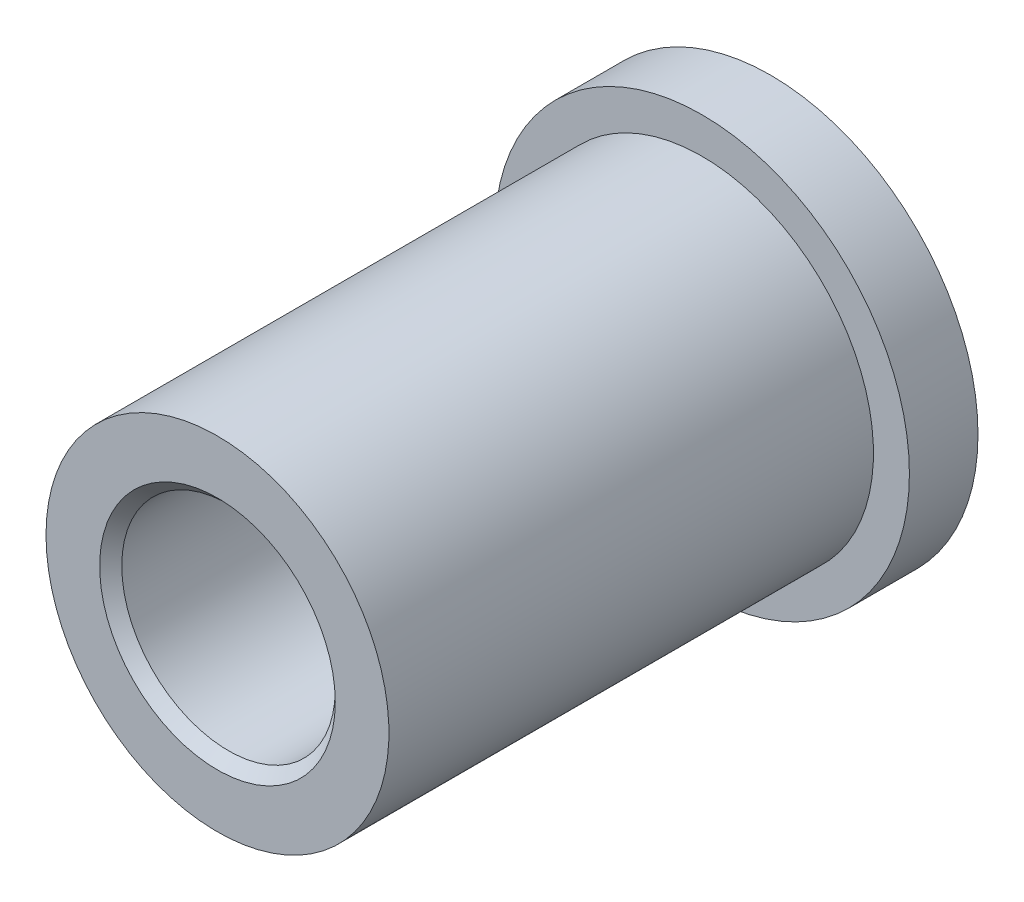
ISO-10303-21;
HEADER;
FILE_DESCRIPTION(('STEP AP214'),'2;1');
FILE_NAME('part.step','',(''),(''),'','','');
FILE_SCHEMA(('AUTOMOTIVE_DESIGN { 1 0 10303 214 1 1 1 1 }'));
ENDSEC;
DATA;
#1=APPLICATION_CONTEXT('core data for automotive mechanical design processes');
#2=APPLICATION_PROTOCOL_DEFINITION('international standard','automotive_design',2000,#1);
#3=PRODUCT_CONTEXT('',#1,'mechanical');
#4=PRODUCT('Part','Part','',(#3));
#5=PRODUCT_RELATED_PRODUCT_CATEGORY('part','',(#4));
#6=PRODUCT_DEFINITION_FORMATION('','',#4);
#7=PRODUCT_DEFINITION_CONTEXT('part definition',#1,'design');
#8=PRODUCT_DEFINITION('design','',#6,#7);
#9=PRODUCT_DEFINITION_SHAPE('','',#8);
#10=(LENGTH_UNIT() NAMED_UNIT(*) SI_UNIT(.MILLI.,.METRE.));
#11=(NAMED_UNIT(*) PLANE_ANGLE_UNIT() SI_UNIT($,.RADIAN.));
#12=(NAMED_UNIT(*) SI_UNIT($,.STERADIAN.) SOLID_ANGLE_UNIT());
#13=UNCERTAINTY_MEASURE_WITH_UNIT(LENGTH_MEASURE(1.E-05),#10,'distance_accuracy_value','');
#14=(GEOMETRIC_REPRESENTATION_CONTEXT(3) GLOBAL_UNCERTAINTY_ASSIGNED_CONTEXT((#13)) GLOBAL_UNIT_ASSIGNED_CONTEXT((#10,
#11,#12)) REPRESENTATION_CONTEXT('',''));
#15=CARTESIAN_POINT('',(0.,0.,0.));
#16=DIRECTION('',(0.,0.,1.));
#17=DIRECTION('',(1.,0.,0.));
#18=AXIS2_PLACEMENT_3D('',#15,#16,#17);
#19=CARTESIAN_POINT('',(2.4511,0.,-12.7));
#20=DIRECTION('',(0.,0.,-1.));
#21=DIRECTION('',(-1.,0.,0.));
#22=AXIS2_PLACEMENT_3D('',#19,#20,#21);
#23=CYLINDRICAL_SURFACE('',#22,3.937);
#24=CARTESIAN_POINT('',(2.4511,0.,0.));
#25=DIRECTION('',(0.,0.,-1.));
#26=DIRECTION('',(-1.,0.,0.));
#27=AXIS2_PLACEMENT_3D('',#24,#25,#26);
#28=CIRCLE('',#27,3.937);
#29=CARTESIAN_POINT('',(-1.4859,0.,0.));
#30=VERTEX_POINT('',#29);
#31=EDGE_CURVE('E57',#30,#30,#28,.T.);
#32=ORIENTED_EDGE('',*,*,#31,.T.);
#33=EDGE_LOOP('',(#32));
#34=FACE_BOUND('',#33,.T.);
#35=CARTESIAN_POINT('',(2.4511,0.,-11.1252));
#36=DIRECTION('',(0.,0.,-1.));
#37=DIRECTION('',(-1.,0.,0.));
#38=AXIS2_PLACEMENT_3D('',#35,#36,#37);
#39=CIRCLE('',#38,3.937);
#40=CARTESIAN_POINT('',(-1.4859,0.,-11.1252));
#41=VERTEX_POINT('',#40);
#42=EDGE_CURVE('E67',#41,#41,#39,.T.);
#43=ORIENTED_EDGE('',*,*,#42,.F.);
#44=EDGE_LOOP('',(#43));
#45=FACE_BOUND('',#44,.T.);
#46=ADVANCED_FACE('F37',(#34,#45),#23,.T.);
#47=CARTESIAN_POINT('',(0.,0.,0.));
#48=DIRECTION('',(0.,0.,1.));
#49=DIRECTION('',(1.,0.,0.));
#50=AXIS2_PLACEMENT_3D('',#47,#48,#49);
#51=PLANE('',#50);
#52=CARTESIAN_POINT('',(2.4511,0.,0.));
#53=DIRECTION('',(0.,0.,1.));
#54=DIRECTION('',(1.,0.,0.));
#55=AXIS2_PLACEMENT_3D('',#52,#53,#54);
#56=CIRCLE('',#55,2.7051);
#57=CARTESIAN_POINT('',(5.1562,0.,0.));
#58=VERTEX_POINT('',#57);
#59=EDGE_CURVE('E52',#58,#58,#56,.F.);
#60=ORIENTED_EDGE('',*,*,#59,.T.);
#61=EDGE_LOOP('',(#60));
#62=FACE_BOUND('',#61,.T.);
#63=ORIENTED_EDGE('',*,*,#31,.F.);
#64=EDGE_LOOP('',(#63));
#65=FACE_BOUND('',#64,.T.);
#66=ADVANCED_FACE('F75',(#62,#65),#51,.T.);
#67=CARTESIAN_POINT('',(2.4511,0.,-12.7));
#68=DIRECTION('',(0.,0.,-1.));
#69=DIRECTION('',(-1.,0.,0.));
#70=AXIS2_PLACEMENT_3D('',#67,#68,#69);
#71=CYLINDRICAL_SURFACE('',#70,2.4511);
#72=CARTESIAN_POINT('',(2.4511,0.,-0.253999999999999));
#73=DIRECTION('',(0.,0.,1.));
#74=DIRECTION('',(1.,0.,0.));
#75=AXIS2_PLACEMENT_3D('',#72,#73,#74);
#76=CIRCLE('',#75,2.4511);
#77=CARTESIAN_POINT('',(4.9022,0.,-0.253999999999999));
#78=VERTEX_POINT('',#77);
#79=EDGE_CURVE('E44',#78,#78,#76,.T.);
#80=ORIENTED_EDGE('',*,*,#79,.T.);
#81=EDGE_LOOP('',(#80));
#82=FACE_BOUND('',#81,.T.);
#83=CARTESIAN_POINT('',(2.4511,0.,-12.446));
#84=DIRECTION('',(0.,0.,-1.));
#85=DIRECTION('',(-1.,0.,0.));
#86=AXIS2_PLACEMENT_3D('',#83,#84,#85);
#87=CIRCLE('',#86,2.4511);
#88=CARTESIAN_POINT('',(0.,0.,-12.446));
#89=VERTEX_POINT('',#88);
#90=EDGE_CURVE('E48',#89,#89,#87,.T.);
#91=ORIENTED_EDGE('',*,*,#90,.T.);
#92=EDGE_LOOP('',(#91));
#93=FACE_BOUND('',#92,.T.);
#94=ADVANCED_FACE('F81',(#82,#93),#71,.F.);
#95=CARTESIAN_POINT('',(0.,0.,-12.7));
#96=DIRECTION('',(0.,0.,-1.));
#97=DIRECTION('',(-1.,0.,0.));
#98=AXIS2_PLACEMENT_3D('',#95,#96,#97);
#99=PLANE('',#98);
#100=CARTESIAN_POINT('',(2.4511,0.,-12.7));
#101=DIRECTION('',(0.,0.,-1.));
#102=DIRECTION('',(-1.,0.,0.));
#103=AXIS2_PLACEMENT_3D('',#100,#101,#102);
#104=CIRCLE('',#103,2.7051);
#105=CARTESIAN_POINT('',(-0.254000000000003,0.,-12.7));
#106=VERTEX_POINT('',#105);
#107=EDGE_CURVE('E10',#106,#106,#104,.F.);
#108=ORIENTED_EDGE('',*,*,#107,.T.);
#109=EDGE_LOOP('',(#108));
#110=FACE_BOUND('',#109,.T.);
#111=CARTESIAN_POINT('',(2.4511,0.,-12.7));
#112=DIRECTION('',(0.,0.,-1.));
#113=DIRECTION('',(-1.,0.,0.));
#114=AXIS2_PLACEMENT_3D('',#111,#112,#113);
#115=CIRCLE('',#114,4.7625);
#116=CARTESIAN_POINT('',(-2.3114,0.,-12.7));
#117=VERTEX_POINT('',#116);
#118=EDGE_CURVE('E61',#117,#117,#115,.T.);
#119=ORIENTED_EDGE('',*,*,#118,.T.);
#120=EDGE_LOOP('',(#119));
#121=FACE_BOUND('',#120,.T.);
#122=ADVANCED_FACE('F102',(#110,#121),#99,.T.);
#123=CARTESIAN_POINT('',(2.4511,0.,-12.7));
#124=DIRECTION('',(0.,0.,-1.));
#125=DIRECTION('',(-1.,0.,0.));
#126=AXIS2_PLACEMENT_3D('',#123,#124,#125);
#127=CYLINDRICAL_SURFACE('',#126,4.7625);
#128=CARTESIAN_POINT('',(2.4511,0.,-11.1252));
#129=DIRECTION('',(0.,0.,-1.));
#130=DIRECTION('',(-1.,0.,0.));
#131=AXIS2_PLACEMENT_3D('',#128,#129,#130);
#132=CIRCLE('',#131,4.7625);
#133=CARTESIAN_POINT('',(-2.3114,0.,-11.1252));
#134=VERTEX_POINT('',#133);
#135=EDGE_CURVE('E64',#134,#134,#132,.T.);
#136=ORIENTED_EDGE('',*,*,#135,.T.);
#137=EDGE_LOOP('',(#136));
#138=FACE_BOUND('',#137,.T.);
#139=ORIENTED_EDGE('',*,*,#118,.F.);
#140=EDGE_LOOP('',(#139));
#141=FACE_BOUND('',#140,.T.);
#142=ADVANCED_FACE('F93',(#138,#141),#127,.T.);
#143=CARTESIAN_POINT('',(0.,0.,-11.1252));
#144=DIRECTION('',(0.,0.,1.));
#145=DIRECTION('',(1.,0.,0.));
#146=AXIS2_PLACEMENT_3D('',#143,#144,#145);
#147=PLANE('',#146);
#148=ORIENTED_EDGE('',*,*,#42,.T.);
#149=EDGE_LOOP('',(#148));
#150=FACE_BOUND('',#149,.T.);
#151=ORIENTED_EDGE('',*,*,#135,.F.);
#152=EDGE_LOOP('',(#151));
#153=FACE_BOUND('',#152,.T.);
#154=ADVANCED_FACE('F71',(#150,#153),#147,.T.);
#155=CARTESIAN_POINT('',(2.4511,0.,0.));
#156=DIRECTION('',(0.,0.,1.));
#157=DIRECTION('',(1.,0.,0.));
#158=AXIS2_PLACEMENT_3D('',#155,#156,#157);
#159=CONICAL_SURFACE('',#158,2.7051,0.785398163397447);
#160=ORIENTED_EDGE('',*,*,#79,.F.);
#161=EDGE_LOOP('',(#160));
#162=FACE_BOUND('',#161,.T.);
#163=ORIENTED_EDGE('',*,*,#59,.F.);
#164=EDGE_LOOP('',(#163));
#165=FACE_BOUND('',#164,.T.);
#166=ADVANCED_FACE('F85',(#162,#165),#159,.F.);
#167=CARTESIAN_POINT('',(2.4511,0.,-12.446));
#168=DIRECTION('',(0.,0.,-1.));
#169=DIRECTION('',(-1.,0.,0.));
#170=AXIS2_PLACEMENT_3D('',#167,#168,#169);
#171=CONICAL_SURFACE('',#170,2.4511,0.785398163397452);
#172=ORIENTED_EDGE('',*,*,#107,.F.);
#173=EDGE_LOOP('',(#172));
#174=FACE_BOUND('',#173,.T.);
#175=ORIENTED_EDGE('',*,*,#90,.F.);
#176=EDGE_LOOP('',(#175));
#177=FACE_BOUND('',#176,.T.);
#178=ADVANCED_FACE('F39',(#174,#177),#171,.F.);
#179=CLOSED_SHELL('',(#46,#66,#94,#122,#142,#154,#166,#178));
#180=MANIFOLD_SOLID_BREP('B2',#179);
#181=ADVANCED_BREP_SHAPE_REPRESENTATION('',(#18,#180),#14);
#182=SHAPE_DEFINITION_REPRESENTATION(#9,#181);
ENDSEC;
END-ISO-10303-21;
